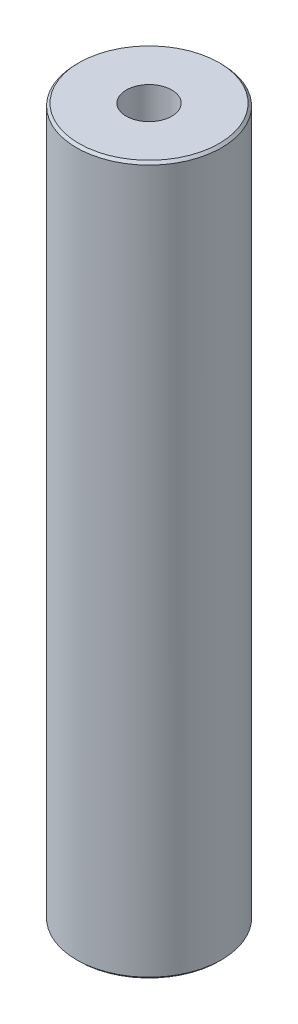
ISO-10303-21;
HEADER;
FILE_DESCRIPTION(('STEP AP214'),'2;1');
FILE_NAME('part.step','',(''),(''),'','','');
FILE_SCHEMA(('AUTOMOTIVE_DESIGN { 1 0 10303 214 1 1 1 1 }'));
ENDSEC;
DATA;
#1=APPLICATION_CONTEXT('core data for automotive mechanical design processes');
#2=APPLICATION_PROTOCOL_DEFINITION('international standard','automotive_design',2000,#1);
#3=PRODUCT_CONTEXT('',#1,'mechanical');
#4=PRODUCT('Part','Part','',(#3));
#5=PRODUCT_RELATED_PRODUCT_CATEGORY('part','',(#4));
#6=PRODUCT_DEFINITION_FORMATION('','',#4);
#7=PRODUCT_DEFINITION_CONTEXT('part definition',#1,'design');
#8=PRODUCT_DEFINITION('design','',#6,#7);
#9=PRODUCT_DEFINITION_SHAPE('','',#8);
#10=(LENGTH_UNIT() NAMED_UNIT(*) SI_UNIT(.MILLI.,.METRE.));
#11=(NAMED_UNIT(*) PLANE_ANGLE_UNIT() SI_UNIT($,.RADIAN.));
#12=(NAMED_UNIT(*) SI_UNIT($,.STERADIAN.) SOLID_ANGLE_UNIT());
#13=UNCERTAINTY_MEASURE_WITH_UNIT(LENGTH_MEASURE(1.E-05),#10,'distance_accuracy_value','');
#14=(GEOMETRIC_REPRESENTATION_CONTEXT(3) GLOBAL_UNCERTAINTY_ASSIGNED_CONTEXT((#13)) GLOBAL_UNIT_ASSIGNED_CONTEXT((#10,
#11,#12)) REPRESENTATION_CONTEXT('',''));
#15=CARTESIAN_POINT('',(0.,0.,0.));
#16=DIRECTION('',(0.,0.,1.));
#17=DIRECTION('',(1.,0.,0.));
#18=AXIS2_PLACEMENT_3D('',#15,#16,#17);
#19=CARTESIAN_POINT('',(0.,390.640052340669,0.));
#20=DIRECTION('',(0.,-1.,0.));
#21=DIRECTION('',(0.,0.,-1.));
#22=AXIS2_PLACEMENT_3D('',#19,#20,#21);
#23=CYLINDRICAL_SURFACE('',#22,40.);
#24=CARTESIAN_POINT('',(0.,389.285215660756,0.));
#25=DIRECTION('',(0.,1.,0.));
#26=DIRECTION('',(0.,0.,1.));
#27=AXIS2_PLACEMENT_3D('',#24,#25,#26);
#28=CIRCLE('',#27,40.);
#29=CARTESIAN_POINT('',(0.,389.285215660756,-40.));
#30=VERTEX_POINT('',#29);
#31=EDGE_CURVE('E50',#30,#30,#28,.F.);
#32=CARTESIAN_POINT('',(0.,1.35483667991398,0.));
#33=DIRECTION('',(0.,1.,0.));
#34=DIRECTION('',(0.,0.,1.));
#35=AXIS2_PLACEMENT_3D('',#32,#33,#34);
#36=CIRCLE('',#35,40.);
#37=CARTESIAN_POINT('',(0.,1.35483667991393,-40.));
#38=VERTEX_POINT('',#37);
#39=EDGE_CURVE('E51',#38,#38,#36,.T.);
#40=CARTESIAN_POINT('',(0.,389.285215660756,-40.));
#41=CARTESIAN_POINT('',(0.,385.244274213039,-40.));
#42=CARTESIAN_POINT('',(0.,381.203332765322,-40.));
#43=CARTESIAN_POINT('',(0.,373.121449869887,-40.));
#44=CARTESIAN_POINT('',(0.,369.08050842217,-40.));
#45=CARTESIAN_POINT('',(0.,360.998625526736,-40.));
#46=CARTESIAN_POINT('',(0.,356.957684079019,-40.));
#47=CARTESIAN_POINT('',(0.,348.875801183585,-40.));
#48=CARTESIAN_POINT('',(0.,344.834859735868,-40.));
#49=CARTESIAN_POINT('',(0.,336.752976840434,-40.));
#50=CARTESIAN_POINT('',(0.,332.712035392716,-40.));
#51=CARTESIAN_POINT('',(0.,324.630152497282,-40.));
#52=CARTESIAN_POINT('',(0.,320.589211049565,-40.));
#53=CARTESIAN_POINT('',(0.,312.507328154131,-40.));
#54=CARTESIAN_POINT('',(0.,308.466386706414,-40.));
#55=CARTESIAN_POINT('',(0.,300.38450381098,-40.));
#56=CARTESIAN_POINT('',(0.,296.343562363262,-40.));
#57=CARTESIAN_POINT('',(0.,288.261679467828,-40.));
#58=CARTESIAN_POINT('',(0.,284.220738020111,-40.));
#59=CARTESIAN_POINT('',(0.,276.138855124677,-40.));
#60=CARTESIAN_POINT('',(0.,272.09791367696,-40.));
#61=CARTESIAN_POINT('',(0.,264.016030781526,-40.));
#62=CARTESIAN_POINT('',(0.,259.975089333809,-40.));
#63=CARTESIAN_POINT('',(0.,251.893206438374,-40.));
#64=CARTESIAN_POINT('',(0.,247.852264990657,-40.));
#65=CARTESIAN_POINT('',(0.,239.770382095223,-40.));
#66=CARTESIAN_POINT('',(0.,235.729440647506,-40.));
#67=CARTESIAN_POINT('',(0.,227.647557752072,-40.));
#68=CARTESIAN_POINT('',(0.,223.606616304355,-40.));
#69=CARTESIAN_POINT('',(0.,215.52473340892,-40.));
#70=CARTESIAN_POINT('',(0.,211.483791961203,-40.));
#71=CARTESIAN_POINT('',(0.,203.401909065769,-40.));
#72=CARTESIAN_POINT('',(0.,199.360967618052,-40.));
#73=CARTESIAN_POINT('',(0.,191.279084722618,-40.));
#74=CARTESIAN_POINT('',(0.,187.238143274901,-40.));
#75=CARTESIAN_POINT('',(0.,179.156260379466,-40.));
#76=CARTESIAN_POINT('',(0.,175.115318931749,-40.));
#77=CARTESIAN_POINT('',(0.,167.033436036315,-40.));
#78=CARTESIAN_POINT('',(0.,162.992494588598,-40.));
#79=CARTESIAN_POINT('',(0.,154.910611693164,-40.));
#80=CARTESIAN_POINT('',(0.,150.869670245447,-40.));
#81=CARTESIAN_POINT('',(0.,142.787787350013,-40.));
#82=CARTESIAN_POINT('',(0.,138.746845902295,-40.));
#83=CARTESIAN_POINT('',(0.,130.664963006861,-40.));
#84=CARTESIAN_POINT('',(0.,126.624021559144,-40.));
#85=CARTESIAN_POINT('',(0.,118.54213866371,-40.));
#86=CARTESIAN_POINT('',(0.,114.501197215993,-40.));
#87=CARTESIAN_POINT('',(0.,106.419314320559,-40.));
#88=CARTESIAN_POINT('',(0.,102.378372872842,-40.));
#89=CARTESIAN_POINT('',(0.,94.2964899774073,-40.));
#90=CARTESIAN_POINT('',(0.,90.2555485296902,-40.));
#91=CARTESIAN_POINT('',(0.,82.173665634256,-40.));
#92=CARTESIAN_POINT('',(0.,78.1327241865389,-40.));
#93=CARTESIAN_POINT('',(0.,70.0508412911047,-40.));
#94=CARTESIAN_POINT('',(0.,66.0098998433876,-40.));
#95=CARTESIAN_POINT('',(0.,57.9280169479534,-40.));
#96=CARTESIAN_POINT('',(0.,53.8870755002363,-40.));
#97=CARTESIAN_POINT('',(0.,45.8051926048021,-40.));
#98=CARTESIAN_POINT('',(0.,41.764251157085,-40.));
#99=CARTESIAN_POINT('',(0.,33.6823682616508,-40.));
#100=CARTESIAN_POINT('',(0.,29.6414268139337,-40.));
#101=CARTESIAN_POINT('',(0.,21.5595439184995,-40.));
#102=CARTESIAN_POINT('',(0.,17.5186024707823,-40.));
#103=CARTESIAN_POINT('',(0.,9.43671957534814,-40.));
#104=CARTESIAN_POINT('',(0.,5.39577812763104,-40.));
#105=CARTESIAN_POINT('',(0.,1.35483667991393,-40.));
#106=B_SPLINE_CURVE_WITH_KNOTS('',3,(#40,#41,#42,#43,#44,#45,#46,#47,#48,#49,#50,#51,#52,#53,
#54,#55,#56,#57,#58,#59,#60,#61,#62,#63,#64,#65,#66,#67,#68,#69,#70,#71,#72,#73,#74,#75,#76,#77,
#78,#79,#80,#81,#82,#83,#84,#85,#86,#87,#88,#89,#90,#91,#92,#93,#94,#95,#96,#97,#98,#99,#100,
#101,#102,#103,#104,#105),.UNSPECIFIED.,.F.,.F.,(4,2,2,2,2,2,2,2,2,2,2,2,2,2,2,2,2,2,2,2,2,2,2,
2,2,2,2,2,2,2,2,2,4),(0.,12.1228243431513,24.2456486863026,36.3684730294539,48.4912973726052,
60.6141217157565,72.7369460589078,84.8597704020591,96.9825947452105,109.105419088362,
121.228243431513,133.351067774664,145.473892117816,157.596716460967,169.719540804118,
181.84236514727,193.965189490421,206.088013833572,218.210838176724,230.333662519875,
242.456486863026,254.579311206177,266.702135549329,278.82495989248,290.947784235631,
303.070608578783,315.193432921934,327.316257265085,339.439081608237,351.561905951388,
363.684730294539,375.807554637691,387.930378980842),.UNSPECIFIED.);
#107=EDGE_CURVE('BSEAM39',#30,#38,#106,.T.);
#108=ORIENTED_EDGE('',*,*,#31,.T.);
#109=ORIENTED_EDGE('',*,*,#39,.T.);
#110=ORIENTED_EDGE('',*,*,#107,.T.);
#111=ORIENTED_EDGE('',*,*,#107,.F.);
#112=EDGE_LOOP('',(#108,#110,#109,#111));
#113=FACE_BOUND('',#112,.T.);
#114=ADVANCED_FACE('F39',(#113),#23,.T.);
#115=CARTESIAN_POINT('',(0.,390.640052340669,0.));
#116=DIRECTION('',(0.,1.,0.));
#117=DIRECTION('',(0.,0.,1.));
#118=AXIS2_PLACEMENT_3D('',#115,#116,#117);
#119=PLANE('',#118);
#120=CARTESIAN_POINT('',(0.,390.640052340669,0.));
#121=DIRECTION('',(0.,1.,0.));
#122=DIRECTION('',(0.,0.,1.));
#123=AXIS2_PLACEMENT_3D('',#120,#121,#122);
#124=CIRCLE('',#123,38.6451633200866);
#125=CARTESIAN_POINT('',(0.,390.640052340669,38.6451633200866));
#126=VERTEX_POINT('',#125);
#127=EDGE_CURVE('E54',#126,#126,#124,.T.);
#128=ORIENTED_EDGE('',*,*,#127,.T.);
#129=EDGE_LOOP('',(#128));
#130=FACE_BOUND('',#129,.T.);
#131=CARTESIAN_POINT('',(0.,390.640052340669,0.));
#132=DIRECTION('',(0.,1.,0.));
#133=DIRECTION('',(0.,0.,1.));
#134=AXIS2_PLACEMENT_3D('',#131,#132,#133);
#135=CIRCLE('',#134,12.5527516225808);
#136=CARTESIAN_POINT('',(0.,390.640052340669,-12.5527516225808));
#137=VERTEX_POINT('',#136);
#138=EDGE_CURVE('E58',#137,#137,#135,.T.);
#139=ORIENTED_EDGE('',*,*,#138,.F.);
#140=EDGE_LOOP('',(#139));
#141=FACE_BOUND('',#140,.T.);
#142=ADVANCED_FACE('F69',(#130,#141),#119,.T.);
#143=CARTESIAN_POINT('',(0.,0.,0.));
#144=DIRECTION('',(0.,1.,0.));
#145=DIRECTION('',(0.,0.,1.));
#146=AXIS2_PLACEMENT_3D('',#143,#144,#145);
#147=PLANE('',#146);
#148=CARTESIAN_POINT('',(0.,0.,0.));
#149=DIRECTION('',(0.,1.,0.));
#150=DIRECTION('',(0.,0.,1.));
#151=AXIS2_PLACEMENT_3D('',#148,#149,#150);
#152=CIRCLE('',#151,38.645163320086);
#153=CARTESIAN_POINT('',(0.,0.,38.645163320086));
#154=VERTEX_POINT('',#153);
#155=EDGE_CURVE('E10',#154,#154,#152,.F.);
#156=ORIENTED_EDGE('',*,*,#155,.T.);
#157=EDGE_LOOP('',(#156));
#158=FACE_BOUND('',#157,.T.);
#159=CARTESIAN_POINT('',(0.,0.,0.));
#160=DIRECTION('',(0.,1.,0.));
#161=DIRECTION('',(0.,0.,1.));
#162=AXIS2_PLACEMENT_3D('',#159,#160,#161);
#163=CIRCLE('',#162,12.5527516225808);
#164=CARTESIAN_POINT('',(0.,0.,-12.5527516225808));
#165=VERTEX_POINT('',#164);
#166=EDGE_CURVE('E63',#165,#165,#163,.T.);
#167=ORIENTED_EDGE('',*,*,#166,.T.);
#168=EDGE_LOOP('',(#167));
#169=FACE_BOUND('',#168,.T.);
#170=ADVANCED_FACE('F75',(#158,#169),#147,.F.);
#171=CARTESIAN_POINT('',(0.,390.640052340669,0.));
#172=DIRECTION('',(0.,-1.,0.));
#173=DIRECTION('',(0.,0.,-1.));
#174=AXIS2_PLACEMENT_3D('',#171,#172,#173);
#175=CYLINDRICAL_SURFACE('',#174,12.5527516225808);
#176=CARTESIAN_POINT('',(0.,390.640052340669,-12.5527516225808));
#177=CARTESIAN_POINT('',(0.,386.570885128787,-12.5527516225808));
#178=CARTESIAN_POINT('',(0.,382.501717916905,-12.5527516225808));
#179=CARTESIAN_POINT('',(0.,374.363383493141,-12.5527516225808));
#180=CARTESIAN_POINT('',(0.,370.294216281259,-12.5527516225808));
#181=CARTESIAN_POINT('',(0.,362.155881857496,-12.5527516225808));
#182=CARTESIAN_POINT('',(0.,358.086714645614,-12.5527516225808));
#183=CARTESIAN_POINT('',(0.,349.94838022185,-12.5527516225808));
#184=CARTESIAN_POINT('',(0.,345.879213009968,-12.5527516225808));
#185=CARTESIAN_POINT('',(0.,337.740878586204,-12.5527516225808));
#186=CARTESIAN_POINT('',(0.,333.671711374322,-12.5527516225808));
#187=CARTESIAN_POINT('',(0.,325.533376950558,-12.5527516225808));
#188=CARTESIAN_POINT('',(0.,321.464209738676,-12.5527516225808));
#189=CARTESIAN_POINT('',(0.,313.325875314912,-12.5527516225808));
#190=CARTESIAN_POINT('',(0.,309.25670810303,-12.5527516225808));
#191=CARTESIAN_POINT('',(0.,301.118373679266,-12.5527516225808));
#192=CARTESIAN_POINT('',(0.,297.049206467384,-12.5527516225808));
#193=CARTESIAN_POINT('',(0.,288.91087204362,-12.5527516225808));
#194=CARTESIAN_POINT('',(0.,284.841704831738,-12.5527516225808));
#195=CARTESIAN_POINT('',(0.,276.703370407974,-12.5527516225808));
#196=CARTESIAN_POINT('',(0.,272.634203196092,-12.5527516225808));
#197=CARTESIAN_POINT('',(0.,264.495868772328,-12.5527516225808));
#198=CARTESIAN_POINT('',(0.,260.426701560446,-12.5527516225808));
#199=CARTESIAN_POINT('',(0.,252.288367136682,-12.5527516225808));
#200=CARTESIAN_POINT('',(0.,248.2191999248,-12.5527516225808));
#201=CARTESIAN_POINT('',(0.,240.080865501036,-12.5527516225808));
#202=CARTESIAN_POINT('',(0.,236.011698289154,-12.5527516225808));
#203=CARTESIAN_POINT('',(0.,227.87336386539,-12.5527516225808));
#204=CARTESIAN_POINT('',(0.,223.804196653508,-12.5527516225808));
#205=CARTESIAN_POINT('',(0.,215.665862229744,-12.5527516225808));
#206=CARTESIAN_POINT('',(0.,211.596695017863,-12.5527516225808));
#207=CARTESIAN_POINT('',(0.,203.458360594099,-12.5527516225808));
#208=CARTESIAN_POINT('',(0.,199.389193382217,-12.5527516225808));
#209=CARTESIAN_POINT('',(0.,191.250858958453,-12.5527516225808));
#210=CARTESIAN_POINT('',(0.,187.181691746571,-12.5527516225808));
#211=CARTESIAN_POINT('',(0.,179.043357322807,-12.5527516225808));
#212=CARTESIAN_POINT('',(0.,174.974190110925,-12.5527516225808));
#213=CARTESIAN_POINT('',(0.,166.835855687161,-12.5527516225808));
#214=CARTESIAN_POINT('',(0.,162.766688475279,-12.5527516225808));
#215=CARTESIAN_POINT('',(0.,154.628354051515,-12.5527516225808));
#216=CARTESIAN_POINT('',(0.,150.559186839633,-12.5527516225808));
#217=CARTESIAN_POINT('',(0.,142.420852415869,-12.5527516225808));
#218=CARTESIAN_POINT('',(0.,138.351685203987,-12.5527516225808));
#219=CARTESIAN_POINT('',(0.,130.213350780223,-12.5527516225808));
#220=CARTESIAN_POINT('',(0.,126.144183568341,-12.5527516225808));
#221=CARTESIAN_POINT('',(0.,118.005849144577,-12.5527516225808));
#222=CARTESIAN_POINT('',(0.,113.936681932695,-12.5527516225808));
#223=CARTESIAN_POINT('',(0.,105.798347508931,-12.5527516225808));
#224=CARTESIAN_POINT('',(0.,101.729180297049,-12.5527516225808));
#225=CARTESIAN_POINT('',(0.,93.5908458732853,-12.5527516225808));
#226=CARTESIAN_POINT('',(0.,89.5216786614034,-12.5527516225808));
#227=CARTESIAN_POINT('',(0.,81.3833442376394,-12.5527516225808));
#228=CARTESIAN_POINT('',(0.,77.3141770257574,-12.5527516225808));
#229=CARTESIAN_POINT('',(0.,69.1758426019935,-12.5527516225808));
#230=CARTESIAN_POINT('',(0.,65.1066753901115,-12.5527516225808));
#231=CARTESIAN_POINT('',(0.,56.9683409663476,-12.5527516225808));
#232=CARTESIAN_POINT('',(0.,52.8991737544656,-12.5527516225808));
#233=CARTESIAN_POINT('',(0.,44.7608393307016,-12.5527516225808));
#234=CARTESIAN_POINT('',(0.,40.6916721188197,-12.5527516225808));
#235=CARTESIAN_POINT('',(0.,32.5533376950557,-12.5527516225808));
#236=CARTESIAN_POINT('',(0.,28.4841704831738,-12.5527516225808));
#237=CARTESIAN_POINT('',(0.,20.3458360594098,-12.5527516225808));
#238=CARTESIAN_POINT('',(0.,16.2766688475279,-12.5527516225808));
#239=CARTESIAN_POINT('',(0.,8.1383344237639,-12.5527516225808));
#240=CARTESIAN_POINT('',(0.,4.06916721188191,-12.5527516225808));
#241=CARTESIAN_POINT('',(0.,0.,-12.5527516225808));
#242=B_SPLINE_CURVE_WITH_KNOTS('',3,(#176,#177,#178,#179,#180,#181,#182,#183,#184,#185,#186,
#187,#188,#189,#190,#191,#192,#193,#194,#195,#196,#197,#198,#199,#200,#201,#202,#203,#204,#205,
#206,#207,#208,#209,#210,#211,#212,#213,#214,#215,#216,#217,#218,#219,#220,#221,#222,#223,#224,
#225,#226,#227,#228,#229,#230,#231,#232,#233,#234,#235,#236,#237,#238,#239,#240,#241),
.UNSPECIFIED.,.F.,.F.,(4,2,2,2,2,2,2,2,2,2,2,2,2,2,2,2,2,2,2,2,2,2,2,2,2,2,2,2,2,2,2,2,4),(0.,
12.2075016356459,24.4150032712919,36.6225049069378,48.8300065425837,61.0375081782296,
73.2450098138756,85.4525114495215,97.6600130851674,109.867514720813,122.075016356459,
134.282517992105,146.490019627751,158.697521263397,170.905022899043,183.112524534689,
195.320026170335,207.527527805981,219.735029441627,231.942531077272,244.150032712918,
256.357534348564,268.56503598421,280.772537619856,292.980039255502,305.187540891148,
317.395042526794,329.60254416244,341.810045798086,354.017547433732,366.225049069378,
378.432550705023,390.640052340669),.UNSPECIFIED.);
#243=EDGE_CURVE('BSEAM70',#137,#165,#242,.T.);
#244=ORIENTED_EDGE('',*,*,#138,.T.);
#245=ORIENTED_EDGE('',*,*,#166,.F.);
#246=ORIENTED_EDGE('',*,*,#243,.T.);
#247=ORIENTED_EDGE('',*,*,#243,.F.);
#248=EDGE_LOOP('',(#244,#246,#245,#247));
#249=FACE_BOUND('',#248,.T.);
#250=ADVANCED_FACE('F70',(#249),#175,.F.);
#251=CARTESIAN_POINT('',(0.,390.640052340669,0.));
#252=DIRECTION('',(0.,-1.,0.));
#253=DIRECTION('',(0.,0.,-1.));
#254=AXIS2_PLACEMENT_3D('',#251,#252,#253);
#255=CONICAL_SURFACE('',#254,38.6451633200866,0.785398163397438);
#256=ORIENTED_EDGE('',*,*,#31,.F.);
#257=EDGE_LOOP('',(#256));
#258=FACE_BOUND('',#257,.T.);
#259=ORIENTED_EDGE('',*,*,#127,.F.);
#260=EDGE_LOOP('',(#259));
#261=FACE_BOUND('',#260,.T.);
#262=ADVANCED_FACE('F81',(#258,#261),#255,.T.);
#263=CARTESIAN_POINT('',(0.,1.35483667991398,0.));
#264=DIRECTION('',(0.,1.,0.));
#265=DIRECTION('',(0.,0.,1.));
#266=AXIS2_PLACEMENT_3D('',#263,#264,#265);
#267=CONICAL_SURFACE('',#266,40.,0.785398163397459);
#268=ORIENTED_EDGE('',*,*,#155,.F.);
#269=EDGE_LOOP('',(#268));
#270=FACE_BOUND('',#269,.T.);
#271=ORIENTED_EDGE('',*,*,#39,.F.);
#272=EDGE_LOOP('',(#271));
#273=FACE_BOUND('',#272,.T.);
#274=ADVANCED_FACE('F45',(#270,#273),#267,.T.);
#275=CLOSED_SHELL('',(#114,#142,#170,#250,#262,#274));
#276=MANIFOLD_SOLID_BREP('B2',#275);
#277=ADVANCED_BREP_SHAPE_REPRESENTATION('',(#18,#276),#14);
#278=SHAPE_DEFINITION_REPRESENTATION(#9,#277);
ENDSEC;
END-ISO-10303-21;
